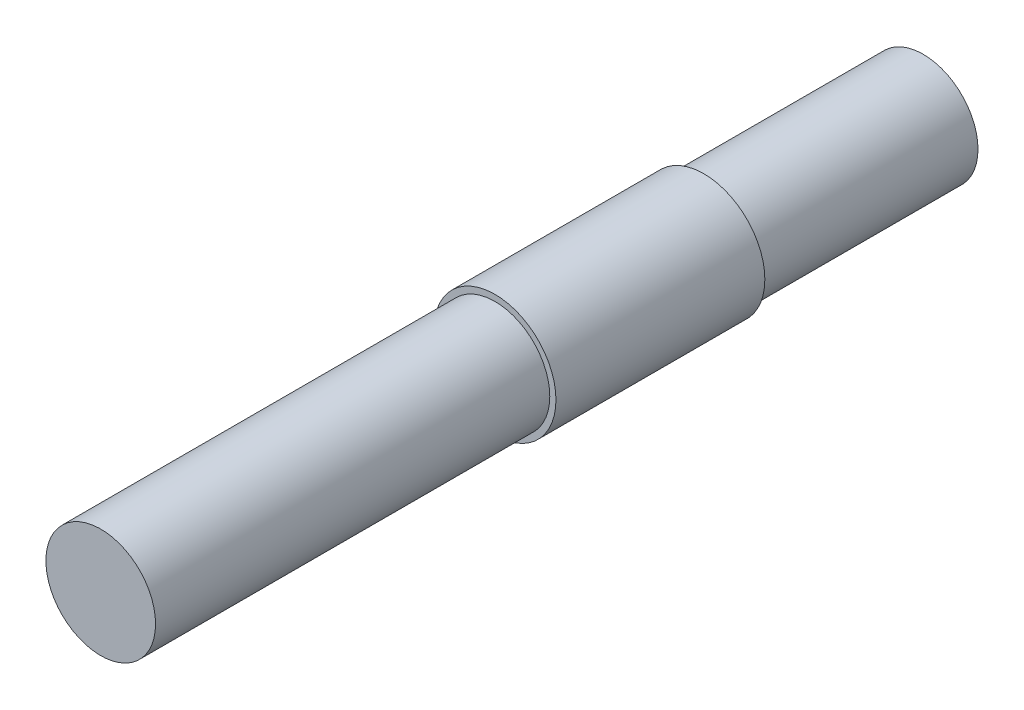
ISO-10303-21;
HEADER;
FILE_DESCRIPTION(('STEP AP214'),'2;1');
FILE_NAME('part.step','',(''),(''),'','','');
FILE_SCHEMA(('AUTOMOTIVE_DESIGN { 1 0 10303 214 1 1 1 1 }'));
ENDSEC;
DATA;
#1=APPLICATION_CONTEXT('core data for automotive mechanical design processes');
#2=APPLICATION_PROTOCOL_DEFINITION('international standard','automotive_design',2000,#1);
#3=PRODUCT_CONTEXT('',#1,'mechanical');
#4=PRODUCT('Part','Part','',(#3));
#5=PRODUCT_RELATED_PRODUCT_CATEGORY('part','',(#4));
#6=PRODUCT_DEFINITION_FORMATION('','',#4);
#7=PRODUCT_DEFINITION_CONTEXT('part definition',#1,'design');
#8=PRODUCT_DEFINITION('design','',#6,#7);
#9=PRODUCT_DEFINITION_SHAPE('','',#8);
#10=(LENGTH_UNIT() NAMED_UNIT(*) SI_UNIT(.MILLI.,.METRE.));
#11=(NAMED_UNIT(*) PLANE_ANGLE_UNIT() SI_UNIT($,.RADIAN.));
#12=(NAMED_UNIT(*) SI_UNIT($,.STERADIAN.) SOLID_ANGLE_UNIT());
#13=UNCERTAINTY_MEASURE_WITH_UNIT(LENGTH_MEASURE(1.E-05),#10,'distance_accuracy_value','');
#14=(GEOMETRIC_REPRESENTATION_CONTEXT(3) GLOBAL_UNCERTAINTY_ASSIGNED_CONTEXT((#13)) GLOBAL_UNIT_ASSIGNED_CONTEXT((#10,
#11,#12)) REPRESENTATION_CONTEXT('',''));
#15=CARTESIAN_POINT('',(0.,0.,0.));
#16=DIRECTION('',(0.,0.,1.));
#17=DIRECTION('',(1.,0.,0.));
#18=AXIS2_PLACEMENT_3D('',#15,#16,#17);
#19=CARTESIAN_POINT('',(0.,0.,75.));
#20=DIRECTION('',(0.,0.,-1.));
#21=DIRECTION('',(-1.,0.,0.));
#22=AXIS2_PLACEMENT_3D('',#19,#20,#21);
#23=CYLINDRICAL_SURFACE('',#22,5.5626);
#24=CARTESIAN_POINT('',(0.,0.,20.));
#25=DIRECTION('',(0.,0.,1.));
#26=DIRECTION('',(1.,0.,0.));
#27=AXIS2_PLACEMENT_3D('',#24,#25,#26);
#28=CIRCLE('',#27,5.5626);
#29=CARTESIAN_POINT('',(5.5626,0.,20.));
#30=VERTEX_POINT('',#29);
#31=EDGE_CURVE('E39',#30,#30,#28,.T.);
#32=ORIENTED_EDGE('',*,*,#31,.T.);
#33=EDGE_LOOP('',(#32));
#34=FACE_BOUND('',#33,.T.);
#35=CARTESIAN_POINT('',(0.,0.,39.05));
#36=DIRECTION('',(0.,0.,1.));
#37=DIRECTION('',(1.,0.,0.));
#38=AXIS2_PLACEMENT_3D('',#35,#36,#37);
#39=CIRCLE('',#38,5.5626);
#40=CARTESIAN_POINT('',(5.5626,0.,39.05));
#41=VERTEX_POINT('',#40);
#42=EDGE_CURVE('E47',#41,#41,#39,.T.);
#43=ORIENTED_EDGE('',*,*,#42,.F.);
#44=EDGE_LOOP('',(#43));
#45=FACE_BOUND('',#44,.T.);
#46=ADVANCED_FACE('F33',(#34,#45),#23,.T.);
#47=CARTESIAN_POINT('',(0.,0.,20.));
#48=DIRECTION('',(0.,0.,1.));
#49=DIRECTION('',(1.,0.,0.));
#50=AXIS2_PLACEMENT_3D('',#47,#48,#49);
#51=PLANE('',#50);
#52=CARTESIAN_POINT('',(0.,0.,20.));
#53=DIRECTION('',(0.,0.,1.));
#54=DIRECTION('',(1.,0.,0.));
#55=AXIS2_PLACEMENT_3D('',#52,#53,#54);
#56=CIRCLE('',#55,5.);
#57=CARTESIAN_POINT('',(5.,0.,20.));
#58=VERTEX_POINT('',#57);
#59=EDGE_CURVE('E43',#58,#58,#56,.T.);
#60=ORIENTED_EDGE('',*,*,#59,.T.);
#61=EDGE_LOOP('',(#60));
#62=FACE_BOUND('',#61,.T.);
#63=ORIENTED_EDGE('',*,*,#31,.F.);
#64=EDGE_LOOP('',(#63));
#65=FACE_BOUND('',#64,.T.);
#66=ADVANCED_FACE('F76',(#62,#65),#51,.F.);
#67=CARTESIAN_POINT('',(0.,0.,-15.7334087241132));
#68=DIRECTION('',(0.,0.,1.));
#69=DIRECTION('',(1.,0.,0.));
#70=AXIS2_PLACEMENT_3D('',#67,#68,#69);
#71=CYLINDRICAL_SURFACE('',#70,5.);
#72=CARTESIAN_POINT('',(0.,0.,0.));
#73=DIRECTION('',(0.,0.,1.));
#74=DIRECTION('',(1.,0.,0.));
#75=AXIS2_PLACEMENT_3D('',#72,#73,#74);
#76=CIRCLE('',#75,5.);
#77=CARTESIAN_POINT('',(5.,0.,0.));
#78=VERTEX_POINT('',#77);
#79=EDGE_CURVE('E10',#78,#78,#76,.F.);
#80=ORIENTED_EDGE('',*,*,#79,.F.);
#81=EDGE_LOOP('',(#80));
#82=FACE_BOUND('',#81,.T.);
#83=ORIENTED_EDGE('',*,*,#59,.F.);
#84=EDGE_LOOP('',(#83));
#85=FACE_BOUND('',#84,.T.);
#86=ADVANCED_FACE('F73',(#82,#85),#71,.T.);
#87=CARTESIAN_POINT('',(0.,0.,0.));
#88=DIRECTION('',(0.,0.,1.));
#89=DIRECTION('',(1.,0.,0.));
#90=AXIS2_PLACEMENT_3D('',#87,#88,#89);
#91=PLANE('',#90);
#92=ORIENTED_EDGE('',*,*,#79,.T.);
#93=EDGE_LOOP('',(#92));
#94=FACE_BOUND('',#93,.T.);
#95=ADVANCED_FACE('F64',(#94),#91,.F.);
#96=CARTESIAN_POINT('',(0.,0.,39.05));
#97=DIRECTION('',(0.,0.,1.));
#98=DIRECTION('',(1.,0.,0.));
#99=AXIS2_PLACEMENT_3D('',#96,#97,#98);
#100=PLANE('',#99);
#101=ORIENTED_EDGE('',*,*,#42,.T.);
#102=EDGE_LOOP('',(#101));
#103=FACE_BOUND('',#102,.T.);
#104=CARTESIAN_POINT('',(0.,0.,39.05));
#105=DIRECTION('',(0.,0.,1.));
#106=DIRECTION('',(1.,0.,0.));
#107=AXIS2_PLACEMENT_3D('',#104,#105,#106);
#108=CIRCLE('',#107,5.);
#109=CARTESIAN_POINT('',(5.,0.,39.05));
#110=VERTEX_POINT('',#109);
#111=EDGE_CURVE('E53',#110,#110,#108,.T.);
#112=ORIENTED_EDGE('',*,*,#111,.F.);
#113=EDGE_LOOP('',(#112));
#114=FACE_BOUND('',#113,.T.);
#115=ADVANCED_FACE('F62',(#103,#114),#100,.T.);
#116=CARTESIAN_POINT('',(0.,0.,90.7334087241132));
#117=DIRECTION('',(0.,0.,-1.));
#118=DIRECTION('',(-1.,0.,0.));
#119=AXIS2_PLACEMENT_3D('',#116,#117,#118);
#120=CYLINDRICAL_SURFACE('',#119,5.);
#121=ORIENTED_EDGE('',*,*,#111,.T.);
#122=EDGE_LOOP('',(#121));
#123=FACE_BOUND('',#122,.T.);
#124=CARTESIAN_POINT('',(0.,0.,75.));
#125=DIRECTION('',(0.,0.,1.));
#126=DIRECTION('',(1.,0.,0.));
#127=AXIS2_PLACEMENT_3D('',#124,#125,#126);
#128=CIRCLE('',#127,5.);
#129=CARTESIAN_POINT('',(5.,0.,75.));
#130=VERTEX_POINT('',#129);
#131=EDGE_CURVE('E50',#130,#130,#128,.T.);
#132=ORIENTED_EDGE('',*,*,#131,.F.);
#133=EDGE_LOOP('',(#132));
#134=FACE_BOUND('',#133,.T.);
#135=ADVANCED_FACE('F59',(#123,#134),#120,.T.);
#136=CARTESIAN_POINT('',(0.,0.,75.));
#137=DIRECTION('',(0.,0.,1.));
#138=DIRECTION('',(1.,0.,0.));
#139=AXIS2_PLACEMENT_3D('',#136,#137,#138);
#140=PLANE('',#139);
#141=ORIENTED_EDGE('',*,*,#131,.T.);
#142=EDGE_LOOP('',(#141));
#143=FACE_BOUND('',#142,.T.);
#144=ADVANCED_FACE('F71',(#143),#140,.T.);
#145=CLOSED_SHELL('',(#46,#66,#86,#95,#115,#135,#144));
#146=MANIFOLD_SOLID_BREP('B2',#145);
#147=ADVANCED_BREP_SHAPE_REPRESENTATION('',(#18,#146),#14);
#148=SHAPE_DEFINITION_REPRESENTATION(#9,#147);
ENDSEC;
END-ISO-10303-21;
